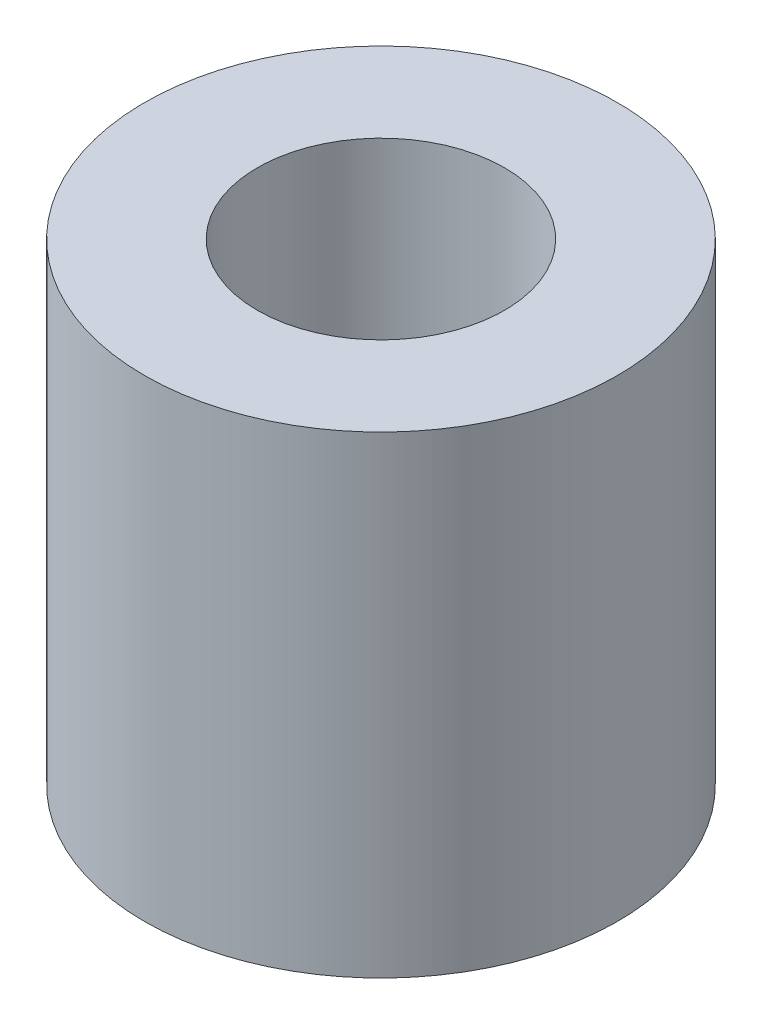
ISO-10303-21;
HEADER;
FILE_DESCRIPTION(('STEP AP214'),'2;1');
FILE_NAME('part.step','',(''),(''),'','','');
FILE_SCHEMA(('AUTOMOTIVE_DESIGN { 1 0 10303 214 1 1 1 1 }'));
ENDSEC;
DATA;
#1=APPLICATION_CONTEXT('core data for automotive mechanical design processes');
#2=APPLICATION_PROTOCOL_DEFINITION('international standard','automotive_design',2000,#1);
#3=PRODUCT_CONTEXT('',#1,'mechanical');
#4=PRODUCT('Part','Part','',(#3));
#5=PRODUCT_RELATED_PRODUCT_CATEGORY('part','',(#4));
#6=PRODUCT_DEFINITION_FORMATION('','',#4);
#7=PRODUCT_DEFINITION_CONTEXT('part definition',#1,'design');
#8=PRODUCT_DEFINITION('design','',#6,#7);
#9=PRODUCT_DEFINITION_SHAPE('','',#8);
#10=(LENGTH_UNIT() NAMED_UNIT(*) SI_UNIT(.MILLI.,.METRE.));
#11=(NAMED_UNIT(*) PLANE_ANGLE_UNIT() SI_UNIT($,.RADIAN.));
#12=(NAMED_UNIT(*) SI_UNIT($,.STERADIAN.) SOLID_ANGLE_UNIT());
#13=UNCERTAINTY_MEASURE_WITH_UNIT(LENGTH_MEASURE(1.E-05),#10,'distance_accuracy_value','');
#14=(GEOMETRIC_REPRESENTATION_CONTEXT(3) GLOBAL_UNCERTAINTY_ASSIGNED_CONTEXT((#13)) GLOBAL_UNIT_ASSIGNED_CONTEXT((#10,
#11,#12)) REPRESENTATION_CONTEXT('',''));
#15=CARTESIAN_POINT('',(0.,0.,0.));
#16=DIRECTION('',(0.,0.,1.));
#17=DIRECTION('',(1.,0.,0.));
#18=AXIS2_PLACEMENT_3D('',#15,#16,#17);
#19=CARTESIAN_POINT('',(0.,9.525,0.));
#20=DIRECTION('',(0.,1.,0.));
#21=DIRECTION('',(0.,0.,1.));
#22=AXIS2_PLACEMENT_3D('',#19,#20,#21);
#23=PLANE('',#22);
#24=CARTESIAN_POINT('',(0.,9.525,0.));
#25=DIRECTION('',(0.,1.,0.));
#26=DIRECTION('',(0.,0.,1.));
#27=AXIS2_PLACEMENT_3D('',#24,#25,#26);
#28=CIRCLE('',#27,4.7625);
#29=CARTESIAN_POINT('',(0.,9.525,4.7625));
#30=VERTEX_POINT('',#29);
#31=EDGE_CURVE('E10',#30,#30,#28,.T.);
#32=ORIENTED_EDGE('',*,*,#31,.T.);
#33=EDGE_LOOP('',(#32));
#34=FACE_BOUND('',#33,.T.);
#35=CARTESIAN_POINT('',(0.,9.525,0.));
#36=DIRECTION('',(0.,1.,0.));
#37=DIRECTION('',(0.,0.,1.));
#38=AXIS2_PLACEMENT_3D('',#35,#36,#37);
#39=CIRCLE('',#38,2.4892);
#40=CARTESIAN_POINT('',(0.,9.525,2.4892));
#41=VERTEX_POINT('',#40);
#42=EDGE_CURVE('E44',#41,#41,#39,.T.);
#43=ORIENTED_EDGE('',*,*,#42,.F.);
#44=EDGE_LOOP('',(#43));
#45=FACE_BOUND('',#44,.T.);
#46=ADVANCED_FACE('F33',(#34,#45),#23,.T.);
#47=CARTESIAN_POINT('',(0.,0.,0.));
#48=DIRECTION('',(0.,1.,0.));
#49=DIRECTION('',(0.,0.,1.));
#50=AXIS2_PLACEMENT_3D('',#47,#48,#49);
#51=PLANE('',#50);
#52=CARTESIAN_POINT('',(0.,0.,0.));
#53=DIRECTION('',(0.,1.,0.));
#54=DIRECTION('',(0.,0.,1.));
#55=AXIS2_PLACEMENT_3D('',#52,#53,#54);
#56=CIRCLE('',#55,4.7625);
#57=CARTESIAN_POINT('',(0.,0.,4.7625));
#58=VERTEX_POINT('',#57);
#59=EDGE_CURVE('E37',#58,#58,#56,.T.);
#60=ORIENTED_EDGE('',*,*,#59,.F.);
#61=EDGE_LOOP('',(#60));
#62=FACE_BOUND('',#61,.T.);
#63=CARTESIAN_POINT('',(0.,0.,0.));
#64=DIRECTION('',(0.,1.,0.));
#65=DIRECTION('',(0.,0.,1.));
#66=AXIS2_PLACEMENT_3D('',#63,#64,#65);
#67=CIRCLE('',#66,2.4892);
#68=CARTESIAN_POINT('',(0.,0.,2.4892));
#69=VERTEX_POINT('',#68);
#70=EDGE_CURVE('E46',#69,#69,#67,.T.);
#71=ORIENTED_EDGE('',*,*,#70,.T.);
#72=EDGE_LOOP('',(#71));
#73=FACE_BOUND('',#72,.T.);
#74=ADVANCED_FACE('F56',(#62,#73),#51,.F.);
#75=CARTESIAN_POINT('',(0.,9.525,0.));
#76=DIRECTION('',(0.,-1.,0.));
#77=DIRECTION('',(0.,0.,-1.));
#78=AXIS2_PLACEMENT_3D('',#75,#76,#77);
#79=CYLINDRICAL_SURFACE('',#78,4.7625);
#80=ORIENTED_EDGE('',*,*,#31,.F.);
#81=EDGE_LOOP('',(#80));
#82=FACE_BOUND('',#81,.T.);
#83=ORIENTED_EDGE('',*,*,#59,.T.);
#84=EDGE_LOOP('',(#83));
#85=FACE_BOUND('',#84,.T.);
#86=ADVANCED_FACE('F35',(#82,#85),#79,.T.);
#87=CARTESIAN_POINT('',(0.,9.525,0.));
#88=DIRECTION('',(0.,-1.,0.));
#89=DIRECTION('',(0.,0.,-1.));
#90=AXIS2_PLACEMENT_3D('',#87,#88,#89);
#91=CYLINDRICAL_SURFACE('',#90,2.4892);
#92=ORIENTED_EDGE('',*,*,#42,.T.);
#93=EDGE_LOOP('',(#92));
#94=FACE_BOUND('',#93,.T.);
#95=ORIENTED_EDGE('',*,*,#70,.F.);
#96=EDGE_LOOP('',(#95));
#97=FACE_BOUND('',#96,.T.);
#98=ADVANCED_FACE('F52',(#94,#97),#91,.F.);
#99=CLOSED_SHELL('',(#46,#74,#86,#98));
#100=MANIFOLD_SOLID_BREP('B2',#99);
#101=ADVANCED_BREP_SHAPE_REPRESENTATION('',(#18,#100),#14);
#102=SHAPE_DEFINITION_REPRESENTATION(#9,#101);
ENDSEC;
END-ISO-10303-21;
